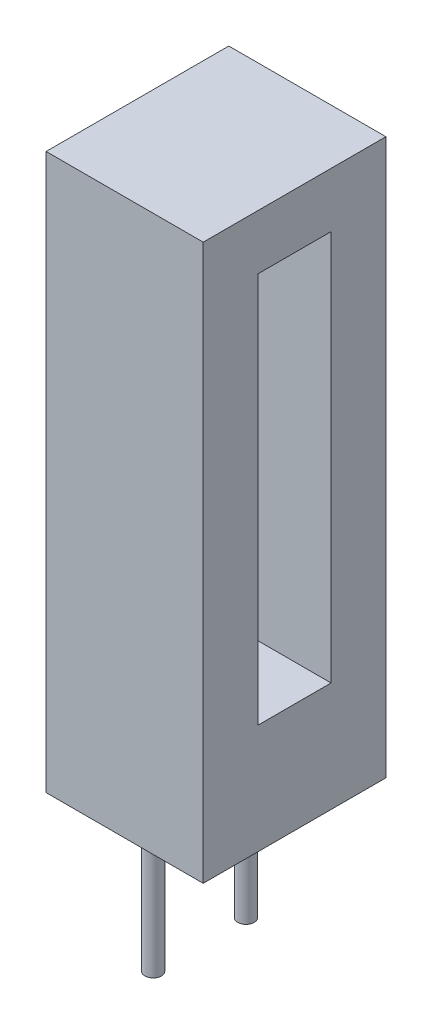
ISO-10303-21;
HEADER;
FILE_DESCRIPTION(('STEP AP214'),'2;1');
FILE_NAME('part.step','',(''),(''),'','','');
FILE_SCHEMA(('AUTOMOTIVE_DESIGN { 1 0 10303 214 1 1 1 1 }'));
ENDSEC;
DATA;
#1=APPLICATION_CONTEXT('core data for automotive mechanical design processes');
#2=APPLICATION_PROTOCOL_DEFINITION('international standard','automotive_design',2000,#1);
#3=PRODUCT_CONTEXT('',#1,'mechanical');
#4=PRODUCT('Part','Part','',(#3));
#5=PRODUCT_RELATED_PRODUCT_CATEGORY('part','',(#4));
#6=PRODUCT_DEFINITION_FORMATION('','',#4);
#7=PRODUCT_DEFINITION_CONTEXT('part definition',#1,'design');
#8=PRODUCT_DEFINITION('design','',#6,#7);
#9=PRODUCT_DEFINITION_SHAPE('','',#8);
#10=(LENGTH_UNIT() NAMED_UNIT(*) SI_UNIT(.MILLI.,.METRE.));
#11=(NAMED_UNIT(*) PLANE_ANGLE_UNIT() SI_UNIT($,.RADIAN.));
#12=(NAMED_UNIT(*) SI_UNIT($,.STERADIAN.) SOLID_ANGLE_UNIT());
#13=UNCERTAINTY_MEASURE_WITH_UNIT(LENGTH_MEASURE(1.E-05),#10,'distance_accuracy_value','');
#14=(GEOMETRIC_REPRESENTATION_CONTEXT(3) GLOBAL_UNCERTAINTY_ASSIGNED_CONTEXT((#13)) GLOBAL_UNIT_ASSIGNED_CONTEXT((#10,
#11,#12)) REPRESENTATION_CONTEXT('',''));
#15=CARTESIAN_POINT('',(0.,0.,0.));
#16=DIRECTION('',(0.,0.,1.));
#17=DIRECTION('',(1.,0.,0.));
#18=AXIS2_PLACEMENT_3D('',#15,#16,#17);
#19=CARTESIAN_POINT('',(0.,15.2,5.));
#20=DIRECTION('',(1.,0.,0.));
#21=DIRECTION('',(0.,0.,-1.));
#22=AXIS2_PLACEMENT_3D('',#19,#20,#21);
#23=PLANE('',#22);
#24=DIRECTION('',(0.,-1.,0.));
#25=VECTOR('',#24,1.);
#26=CARTESIAN_POINT('',(0.,15.2,0.));
#27=LINE('',#26,#25);
#28=CARTESIAN_POINT('',(0.,15.2,0.));
#29=VERTEX_POINT('',#28);
#30=CARTESIAN_POINT('',(0.,0.,0.));
#31=VERTEX_POINT('',#30);
#32=EDGE_CURVE('E148',#29,#31,#27,.T.);
#33=ORIENTED_EDGE('',*,*,#32,.T.);
#34=DIRECTION('',(0.,0.,-1.));
#35=VECTOR('',#34,1.);
#36=CARTESIAN_POINT('',(0.,0.,5.));
#37=LINE('',#36,#35);
#38=CARTESIAN_POINT('',(0.,0.,5.));
#39=VERTEX_POINT('',#38);
#40=EDGE_CURVE('E172',#39,#31,#37,.T.);
#41=ORIENTED_EDGE('',*,*,#40,.F.);
#42=DIRECTION('',(0.,-1.,0.));
#43=VECTOR('',#42,1.);
#44=CARTESIAN_POINT('',(0.,15.2,5.));
#45=LINE('',#44,#43);
#46=CARTESIAN_POINT('',(0.,15.2,5.));
#47=VERTEX_POINT('',#46);
#48=EDGE_CURVE('E152',#47,#39,#45,.T.);
#49=ORIENTED_EDGE('',*,*,#48,.F.);
#50=DIRECTION('',(0.,0.,-1.));
#51=VECTOR('',#50,1.);
#52=CARTESIAN_POINT('',(0.,15.2,5.));
#53=LINE('',#52,#51);
#54=EDGE_CURVE('E158',#47,#29,#53,.T.);
#55=ORIENTED_EDGE('',*,*,#54,.T.);
#56=EDGE_LOOP('',(#33,#41,#49,#55));
#57=FACE_BOUND('',#56,.T.);
#58=ADVANCED_FACE('F36',(#57),#23,.F.);
#59=CARTESIAN_POINT('',(0.,0.,5.));
#60=DIRECTION('',(0.,1.,0.));
#61=DIRECTION('',(0.,0.,1.));
#62=AXIS2_PLACEMENT_3D('',#59,#60,#61);
#63=PLANE('',#62);
#64=CARTESIAN_POINT('',(1.7,0.,3.77));
#65=DIRECTION('',(0.,1.,0.));
#66=DIRECTION('',(0.,0.,1.));
#67=AXIS2_PLACEMENT_3D('',#64,#65,#66);
#68=CIRCLE('',#67,0.225);
#69=CARTESIAN_POINT('',(1.7,0.,3.995));
#70=VERTEX_POINT('',#69);
#71=EDGE_CURVE('E11',#70,#70,#68,.F.);
#72=ORIENTED_EDGE('',*,*,#71,.F.);
#73=EDGE_LOOP('',(#72));
#74=FACE_BOUND('',#73,.T.);
#75=CARTESIAN_POINT('',(1.7,0.,1.23));
#76=DIRECTION('',(0.,1.,0.));
#77=DIRECTION('',(0.,0.,1.));
#78=AXIS2_PLACEMENT_3D('',#75,#76,#77);
#79=CIRCLE('',#78,0.225);
#80=CARTESIAN_POINT('',(1.7,0.,1.455));
#81=VERTEX_POINT('',#80);
#82=EDGE_CURVE('E43',#81,#81,#79,.F.);
#83=ORIENTED_EDGE('',*,*,#82,.F.);
#84=EDGE_LOOP('',(#83));
#85=FACE_BOUND('',#84,.T.);
#86=DIRECTION('',(1.,0.,0.));
#87=VECTOR('',#86,1.);
#88=CARTESIAN_POINT('',(0.,0.,0.));
#89=LINE('',#88,#87);
#90=CARTESIAN_POINT('',(4.3,0.,0.));
#91=VERTEX_POINT('',#90);
#92=EDGE_CURVE('E161',#31,#91,#89,.T.);
#93=ORIENTED_EDGE('',*,*,#92,.T.);
#94=DIRECTION('',(0.,0.,-1.));
#95=VECTOR('',#94,1.);
#96=CARTESIAN_POINT('',(4.3,0.,5.));
#97=LINE('',#96,#95);
#98=CARTESIAN_POINT('',(4.3,0.,5.));
#99=VERTEX_POINT('',#98);
#100=EDGE_CURVE('E169',#99,#91,#97,.T.);
#101=ORIENTED_EDGE('',*,*,#100,.F.);
#102=DIRECTION('',(1.,0.,0.));
#103=VECTOR('',#102,1.);
#104=CARTESIAN_POINT('',(0.,0.,5.));
#105=LINE('',#104,#103);
#106=EDGE_CURVE('E88',#39,#99,#105,.T.);
#107=ORIENTED_EDGE('',*,*,#106,.F.);
#108=ORIENTED_EDGE('',*,*,#40,.T.);
#109=EDGE_LOOP('',(#93,#101,#107,#108));
#110=FACE_BOUND('',#109,.T.);
#111=ADVANCED_FACE('F178',(#74,#85,#110),#63,.F.);
#112=CARTESIAN_POINT('',(4.3,0.,5.));
#113=DIRECTION('',(-1.,0.,0.));
#114=DIRECTION('',(0.,0.,1.));
#115=AXIS2_PLACEMENT_3D('',#112,#113,#114);
#116=PLANE('',#115);
#117=DIRECTION('',(0.,1.,0.));
#118=VECTOR('',#117,1.);
#119=CARTESIAN_POINT('',(4.3,13.7,1.5));
#120=LINE('',#119,#118);
#121=CARTESIAN_POINT('',(4.3,3.,1.5));
#122=VERTEX_POINT('',#121);
#123=CARTESIAN_POINT('',(4.3,13.7,1.5));
#124=VERTEX_POINT('',#123);
#125=EDGE_CURVE('E142',#122,#124,#120,.T.);
#126=ORIENTED_EDGE('',*,*,#125,.F.);
#127=DIRECTION('',(0.,0.,-1.));
#128=VECTOR('',#127,1.);
#129=CARTESIAN_POINT('',(4.3,3.,1.5));
#130=LINE('',#129,#128);
#131=CARTESIAN_POINT('',(4.3,3.,3.5));
#132=VERTEX_POINT('',#131);
#133=EDGE_CURVE('E50',#132,#122,#130,.T.);
#134=ORIENTED_EDGE('',*,*,#133,.F.);
#135=DIRECTION('',(0.,-1.,0.));
#136=VECTOR('',#135,1.);
#137=CARTESIAN_POINT('',(4.3,3.,3.5));
#138=LINE('',#137,#136);
#139=CARTESIAN_POINT('',(4.3,13.7,3.5));
#140=VERTEX_POINT('',#139);
#141=EDGE_CURVE('E130',#140,#132,#138,.T.);
#142=ORIENTED_EDGE('',*,*,#141,.F.);
#143=DIRECTION('',(0.,0.,1.));
#144=VECTOR('',#143,1.);
#145=CARTESIAN_POINT('',(4.3,13.7,3.5));
#146=LINE('',#145,#144);
#147=EDGE_CURVE('E133',#124,#140,#146,.T.);
#148=ORIENTED_EDGE('',*,*,#147,.F.);
#149=EDGE_LOOP('',(#126,#134,#142,#148));
#150=FACE_BOUND('',#149,.T.);
#151=DIRECTION('',(0.,1.,0.));
#152=VECTOR('',#151,1.);
#153=CARTESIAN_POINT('',(4.3,0.,0.));
#154=LINE('',#153,#152);
#155=CARTESIAN_POINT('',(4.3,15.2,0.));
#156=VERTEX_POINT('',#155);
#157=EDGE_CURVE('E163',#91,#156,#154,.T.);
#158=ORIENTED_EDGE('',*,*,#157,.T.);
#159=DIRECTION('',(0.,0.,-1.));
#160=VECTOR('',#159,1.);
#161=CARTESIAN_POINT('',(4.3,15.2,5.));
#162=LINE('',#161,#160);
#163=CARTESIAN_POINT('',(4.3,15.2,5.));
#164=VERTEX_POINT('',#163);
#165=EDGE_CURVE('E167',#164,#156,#162,.T.);
#166=ORIENTED_EDGE('',*,*,#165,.F.);
#167=DIRECTION('',(0.,1.,0.));
#168=VECTOR('',#167,1.);
#169=CARTESIAN_POINT('',(4.3,0.,5.));
#170=LINE('',#169,#168);
#171=EDGE_CURVE('E155',#99,#164,#170,.T.);
#172=ORIENTED_EDGE('',*,*,#171,.F.);
#173=ORIENTED_EDGE('',*,*,#100,.T.);
#174=EDGE_LOOP('',(#158,#166,#172,#173));
#175=FACE_BOUND('',#174,.T.);
#176=ADVANCED_FACE('F180',(#150,#175),#116,.F.);
#177=CARTESIAN_POINT('',(4.3,15.2,5.));
#178=DIRECTION('',(0.,-1.,0.));
#179=DIRECTION('',(0.,0.,-1.));
#180=AXIS2_PLACEMENT_3D('',#177,#178,#179);
#181=PLANE('',#180);
#182=DIRECTION('',(-1.,0.,0.));
#183=VECTOR('',#182,1.);
#184=CARTESIAN_POINT('',(4.3,15.2,0.));
#185=LINE('',#184,#183);
#186=EDGE_CURVE('E80',#156,#29,#185,.T.);
#187=ORIENTED_EDGE('',*,*,#186,.T.);
#188=ORIENTED_EDGE('',*,*,#54,.F.);
#189=DIRECTION('',(-1.,0.,0.));
#190=VECTOR('',#189,1.);
#191=CARTESIAN_POINT('',(4.3,15.2,5.));
#192=LINE('',#191,#190);
#193=EDGE_CURVE('E59',#164,#47,#192,.T.);
#194=ORIENTED_EDGE('',*,*,#193,.F.);
#195=ORIENTED_EDGE('',*,*,#165,.T.);
#196=EDGE_LOOP('',(#187,#188,#194,#195));
#197=FACE_BOUND('',#196,.T.);
#198=ADVANCED_FACE('F192',(#197),#181,.F.);
#199=CARTESIAN_POINT('',(0.,0.,5.));
#200=DIRECTION('',(0.,0.,1.));
#201=DIRECTION('',(1.,0.,0.));
#202=AXIS2_PLACEMENT_3D('',#199,#200,#201);
#203=PLANE('',#202);
#204=ORIENTED_EDGE('',*,*,#48,.T.);
#205=ORIENTED_EDGE('',*,*,#106,.T.);
#206=ORIENTED_EDGE('',*,*,#171,.T.);
#207=ORIENTED_EDGE('',*,*,#193,.T.);
#208=EDGE_LOOP('',(#204,#205,#206,#207));
#209=FACE_BOUND('',#208,.T.);
#210=ADVANCED_FACE('F194',(#209),#203,.T.);
#211=CARTESIAN_POINT('',(0.,0.,0.));
#212=DIRECTION('',(0.,0.,1.));
#213=DIRECTION('',(1.,0.,0.));
#214=AXIS2_PLACEMENT_3D('',#211,#212,#213);
#215=PLANE('',#214);
#216=ORIENTED_EDGE('',*,*,#32,.F.);
#217=ORIENTED_EDGE('',*,*,#186,.F.);
#218=ORIENTED_EDGE('',*,*,#157,.F.);
#219=ORIENTED_EDGE('',*,*,#92,.F.);
#220=EDGE_LOOP('',(#216,#217,#218,#219));
#221=FACE_BOUND('',#220,.T.);
#222=ADVANCED_FACE('F189',(#221),#215,.F.);
#223=CARTESIAN_POINT('',(2.3,3.,1.5));
#224=DIRECTION('',(0.,-1.,0.));
#225=DIRECTION('',(0.,0.,-1.));
#226=AXIS2_PLACEMENT_3D('',#223,#224,#225);
#227=PLANE('',#226);
#228=ORIENTED_EDGE('',*,*,#133,.T.);
#229=DIRECTION('',(1.,0.,0.));
#230=VECTOR('',#229,1.);
#231=CARTESIAN_POINT('',(2.3,3.,1.5));
#232=LINE('',#231,#230);
#233=CARTESIAN_POINT('',(2.3,3.,1.5));
#234=VERTEX_POINT('',#233);
#235=EDGE_CURVE('E108',#234,#122,#232,.T.);
#236=ORIENTED_EDGE('',*,*,#235,.F.);
#237=DIRECTION('',(0.,0.,-1.));
#238=VECTOR('',#237,1.);
#239=CARTESIAN_POINT('',(2.3,3.,1.5));
#240=LINE('',#239,#238);
#241=CARTESIAN_POINT('',(2.3,3.,3.5));
#242=VERTEX_POINT('',#241);
#243=EDGE_CURVE('E112',#242,#234,#240,.T.);
#244=ORIENTED_EDGE('',*,*,#243,.F.);
#245=DIRECTION('',(1.,0.,0.));
#246=VECTOR('',#245,1.);
#247=CARTESIAN_POINT('',(2.3,3.,3.5));
#248=LINE('',#247,#246);
#249=EDGE_CURVE('E146',#242,#132,#248,.T.);
#250=ORIENTED_EDGE('',*,*,#249,.T.);
#251=EDGE_LOOP('',(#228,#236,#244,#250));
#252=FACE_BOUND('',#251,.T.);
#253=ADVANCED_FACE('F110',(#252),#227,.F.);
#254=CARTESIAN_POINT('',(2.3,3.,3.5));
#255=DIRECTION('',(0.,0.,1.));
#256=DIRECTION('',(1.,0.,0.));
#257=AXIS2_PLACEMENT_3D('',#254,#255,#256);
#258=PLANE('',#257);
#259=ORIENTED_EDGE('',*,*,#141,.T.);
#260=ORIENTED_EDGE('',*,*,#249,.F.);
#261=DIRECTION('',(0.,-1.,0.));
#262=VECTOR('',#261,1.);
#263=CARTESIAN_POINT('',(2.3,3.,3.5));
#264=LINE('',#263,#262);
#265=CARTESIAN_POINT('',(2.3,13.7,3.5));
#266=VERTEX_POINT('',#265);
#267=EDGE_CURVE('E118',#266,#242,#264,.T.);
#268=ORIENTED_EDGE('',*,*,#267,.F.);
#269=DIRECTION('',(1.,0.,0.));
#270=VECTOR('',#269,1.);
#271=CARTESIAN_POINT('',(2.3,13.7,3.5));
#272=LINE('',#271,#270);
#273=EDGE_CURVE('E149',#266,#140,#272,.T.);
#274=ORIENTED_EDGE('',*,*,#273,.T.);
#275=EDGE_LOOP('',(#259,#260,#268,#274));
#276=FACE_BOUND('',#275,.T.);
#277=ADVANCED_FACE('F232',(#276),#258,.F.);
#278=CARTESIAN_POINT('',(2.3,13.7,3.5));
#279=DIRECTION('',(0.,1.,0.));
#280=DIRECTION('',(0.,0.,1.));
#281=AXIS2_PLACEMENT_3D('',#278,#279,#280);
#282=PLANE('',#281);
#283=ORIENTED_EDGE('',*,*,#147,.T.);
#284=ORIENTED_EDGE('',*,*,#273,.F.);
#285=DIRECTION('',(0.,0.,1.));
#286=VECTOR('',#285,1.);
#287=CARTESIAN_POINT('',(2.3,13.7,3.5));
#288=LINE('',#287,#286);
#289=CARTESIAN_POINT('',(2.3,13.7,1.5));
#290=VERTEX_POINT('',#289);
#291=EDGE_CURVE('E126',#290,#266,#288,.T.);
#292=ORIENTED_EDGE('',*,*,#291,.F.);
#293=DIRECTION('',(1.,0.,0.));
#294=VECTOR('',#293,1.);
#295=CARTESIAN_POINT('',(2.3,13.7,1.5));
#296=LINE('',#295,#294);
#297=EDGE_CURVE('E117',#290,#124,#296,.T.);
#298=ORIENTED_EDGE('',*,*,#297,.T.);
#299=EDGE_LOOP('',(#283,#284,#292,#298));
#300=FACE_BOUND('',#299,.T.);
#301=ADVANCED_FACE('F241',(#300),#282,.F.);
#302=CARTESIAN_POINT('',(2.3,13.7,1.5));
#303=DIRECTION('',(0.,0.,-1.));
#304=DIRECTION('',(0.,1.,0.));
#305=AXIS2_PLACEMENT_3D('',#302,#303,#304);
#306=PLANE('',#305);
#307=ORIENTED_EDGE('',*,*,#125,.T.);
#308=ORIENTED_EDGE('',*,*,#297,.F.);
#309=DIRECTION('',(0.,1.,0.));
#310=VECTOR('',#309,1.);
#311=CARTESIAN_POINT('',(2.3,13.7,1.5));
#312=LINE('',#311,#310);
#313=EDGE_CURVE('E121',#234,#290,#312,.T.);
#314=ORIENTED_EDGE('',*,*,#313,.F.);
#315=ORIENTED_EDGE('',*,*,#235,.T.);
#316=EDGE_LOOP('',(#307,#308,#314,#315));
#317=FACE_BOUND('',#316,.T.);
#318=ADVANCED_FACE('F122',(#317),#306,.F.);
#319=CARTESIAN_POINT('',(2.3,0.,0.));
#320=DIRECTION('',(-1.,0.,0.));
#321=DIRECTION('',(0.,0.,1.));
#322=AXIS2_PLACEMENT_3D('',#319,#320,#321);
#323=PLANE('',#322);
#324=ORIENTED_EDGE('',*,*,#243,.T.);
#325=ORIENTED_EDGE('',*,*,#313,.T.);
#326=ORIENTED_EDGE('',*,*,#291,.T.);
#327=ORIENTED_EDGE('',*,*,#267,.T.);
#328=EDGE_LOOP('',(#324,#325,#326,#327));
#329=FACE_BOUND('',#328,.T.);
#330=ADVANCED_FACE('F128',(#329),#323,.F.);
#331=CARTESIAN_POINT('',(1.7,-4.,1.23));
#332=DIRECTION('',(0.,1.,0.));
#333=DIRECTION('',(0.,0.,1.));
#334=AXIS2_PLACEMENT_3D('',#331,#332,#333);
#335=CYLINDRICAL_SURFACE('',#334,0.225);
#336=CARTESIAN_POINT('',(1.7,-4.,1.23));
#337=DIRECTION('',(0.,-1.,0.));
#338=DIRECTION('',(0.,0.,-1.));
#339=AXIS2_PLACEMENT_3D('',#336,#337,#338);
#340=CIRCLE('',#339,0.225);
#341=CARTESIAN_POINT('',(1.7,-4.,1.005));
#342=VERTEX_POINT('',#341);
#343=EDGE_CURVE('E136',#342,#342,#340,.T.);
#344=ORIENTED_EDGE('',*,*,#343,.F.);
#345=EDGE_LOOP('',(#344));
#346=FACE_BOUND('',#345,.T.);
#347=ORIENTED_EDGE('',*,*,#82,.T.);
#348=EDGE_LOOP('',(#347));
#349=FACE_BOUND('',#348,.T.);
#350=ADVANCED_FACE('F176',(#346,#349),#335,.T.);
#351=CARTESIAN_POINT('',(1.7,-4.,1.23));
#352=DIRECTION('',(0.,-1.,0.));
#353=DIRECTION('',(0.,0.,-1.));
#354=AXIS2_PLACEMENT_3D('',#351,#352,#353);
#355=PLANE('',#354);
#356=ORIENTED_EDGE('',*,*,#343,.T.);
#357=EDGE_LOOP('',(#356));
#358=FACE_BOUND('',#357,.T.);
#359=ADVANCED_FACE('F274',(#358),#355,.T.);
#360=CARTESIAN_POINT('',(1.7,-4.,3.77));
#361=DIRECTION('',(0.,1.,0.));
#362=DIRECTION('',(0.,0.,1.));
#363=AXIS2_PLACEMENT_3D('',#360,#361,#362);
#364=CYLINDRICAL_SURFACE('',#363,0.225);
#365=CARTESIAN_POINT('',(1.7,-4.,3.77));
#366=DIRECTION('',(0.,-1.,0.));
#367=DIRECTION('',(0.,0.,1.));
#368=AXIS2_PLACEMENT_3D('',#365,#366,#367);
#369=CIRCLE('',#368,0.225);
#370=CARTESIAN_POINT('',(1.7,-4.,3.995));
#371=VERTEX_POINT('',#370);
#372=EDGE_CURVE('E321',#371,#371,#369,.T.);
#373=ORIENTED_EDGE('',*,*,#372,.F.);
#374=EDGE_LOOP('',(#373));
#375=FACE_BOUND('',#374,.T.);
#376=ORIENTED_EDGE('',*,*,#71,.T.);
#377=EDGE_LOOP('',(#376));
#378=FACE_BOUND('',#377,.T.);
#379=ADVANCED_FACE('F281',(#375,#378),#364,.T.);
#380=CARTESIAN_POINT('',(1.7,-4.,3.77));
#381=DIRECTION('',(0.,1.,0.));
#382=DIRECTION('',(0.,0.,1.));
#383=AXIS2_PLACEMENT_3D('',#380,#381,#382);
#384=PLANE('',#383);
#385=ORIENTED_EDGE('',*,*,#372,.T.);
#386=EDGE_LOOP('',(#385));
#387=FACE_BOUND('',#386,.T.);
#388=ADVANCED_FACE('F289',(#387),#384,.F.);
#389=CLOSED_SHELL('',(#58,#111,#176,#198,#210,#222,#253,#277,#301,#318,#330,#350,#359,#379,#388));
#390=MANIFOLD_SOLID_BREP('B2',#389);
#391=ADVANCED_BREP_SHAPE_REPRESENTATION('',(#18,#390),#14);
#392=SHAPE_DEFINITION_REPRESENTATION(#9,#391);
ENDSEC;
END-ISO-10303-21;
